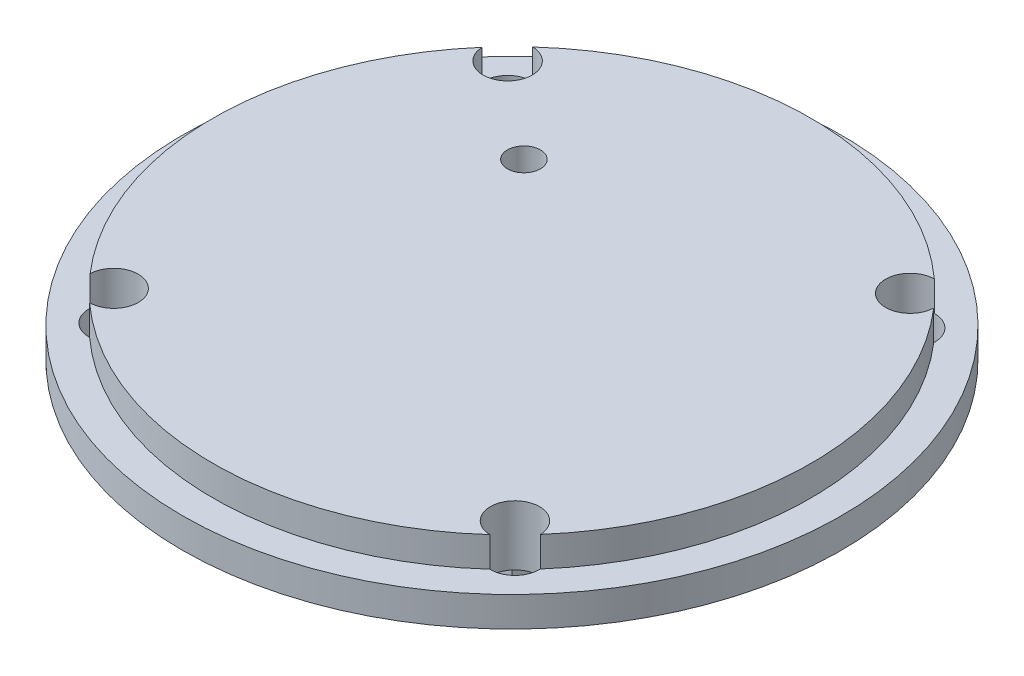
ISO-10303-21;
HEADER;
FILE_DESCRIPTION(('STEP AP214'),'2;1');
FILE_NAME('part.step','',(''),(''),'','','');
FILE_SCHEMA(('AUTOMOTIVE_DESIGN { 1 0 10303 214 1 1 1 1 }'));
ENDSEC;
DATA;
#1=APPLICATION_CONTEXT('core data for automotive mechanical design processes');
#2=APPLICATION_PROTOCOL_DEFINITION('international standard','automotive_design',2000,#1);
#3=PRODUCT_CONTEXT('',#1,'mechanical');
#4=PRODUCT('Part','Part','',(#3));
#5=PRODUCT_RELATED_PRODUCT_CATEGORY('part','',(#4));
#6=PRODUCT_DEFINITION_FORMATION('','',#4);
#7=PRODUCT_DEFINITION_CONTEXT('part definition',#1,'design');
#8=PRODUCT_DEFINITION('design','',#6,#7);
#9=PRODUCT_DEFINITION_SHAPE('','',#8);
#10=(LENGTH_UNIT() NAMED_UNIT(*) SI_UNIT(.MILLI.,.METRE.));
#11=(NAMED_UNIT(*) PLANE_ANGLE_UNIT() SI_UNIT($,.RADIAN.));
#12=(NAMED_UNIT(*) SI_UNIT($,.STERADIAN.) SOLID_ANGLE_UNIT());
#13=UNCERTAINTY_MEASURE_WITH_UNIT(LENGTH_MEASURE(1.E-05),#10,'distance_accuracy_value','');
#14=(GEOMETRIC_REPRESENTATION_CONTEXT(3) GLOBAL_UNCERTAINTY_ASSIGNED_CONTEXT((#13)) GLOBAL_UNIT_ASSIGNED_CONTEXT((#10,
#11,#12)) REPRESENTATION_CONTEXT('',''));
#15=CARTESIAN_POINT('',(0.,0.,0.));
#16=DIRECTION('',(0.,0.,1.));
#17=DIRECTION('',(1.,0.,0.));
#18=AXIS2_PLACEMENT_3D('',#15,#16,#17);
#19=CARTESIAN_POINT('',(0.,10.,0.));
#20=DIRECTION('',(0.,-1.,0.));
#21=DIRECTION('',(0.,0.,-1.));
#22=AXIS2_PLACEMENT_3D('',#19,#20,#21);
#23=CYLINDRICAL_SURFACE('',#22,49.9);
#24=CARTESIAN_POINT('',(0.,5.,0.));
#25=DIRECTION('',(0.,1.,0.));
#26=DIRECTION('',(0.,0.,1.));
#27=AXIS2_PLACEMENT_3D('',#24,#25,#26);
#28=CIRCLE('',#27,49.9);
#29=CARTESIAN_POINT('',(33.5133115533416,5.,-36.9711772699851));
#30=VERTEX_POINT('',#29);
#31=CARTESIAN_POINT('',(-33.5127812139844,5.,-36.9716580004686));
#32=VERTEX_POINT('',#31);
#33=EDGE_CURVE('E179',#30,#32,#28,.T.);
#34=ORIENTED_EDGE('',*,*,#33,.T.);
#35=DIRECTION('',(0.,-1.,0.));
#36=VECTOR('',#35,1.);
#37=CARTESIAN_POINT('',(-33.5127812139844,5.,-36.9716580004685));
#38=LINE('',#37,#36);
#39=CARTESIAN_POINT('',(-33.5127812139844,10.,-36.9716580004685));
#40=VERTEX_POINT('',#39);
#41=EDGE_CURVE('E266',#32,#40,#38,.F.);
#42=ORIENTED_EDGE('',*,*,#41,.T.);
#43=CARTESIAN_POINT('',(0.,10.,0.));
#44=DIRECTION('',(0.,1.,0.));
#45=DIRECTION('',(0.,0.,1.));
#46=AXIS2_PLACEMENT_3D('',#43,#44,#45);
#47=CIRCLE('',#46,49.9);
#48=CARTESIAN_POINT('',(33.5133115533416,10.,-36.9711772699851));
#49=VERTEX_POINT('',#48);
#50=EDGE_CURVE('E178',#49,#40,#47,.T.);
#51=ORIENTED_EDGE('',*,*,#50,.F.);
#52=DIRECTION('',(0.,-1.,0.));
#53=VECTOR('',#52,1.);
#54=CARTESIAN_POINT('',(33.5133115533416,5.,-36.971177269985));
#55=LINE('',#54,#53);
#56=EDGE_CURVE('E273',#49,#30,#55,.T.);
#57=ORIENTED_EDGE('',*,*,#56,.T.);
#58=EDGE_LOOP('',(#34,#42,#51,#57));
#59=FACE_BOUND('',#58,.T.);
#60=ADVANCED_FACE('F46',(#59),#23,.T.);
#61=CARTESIAN_POINT('',(-37.6882981979145,10.,-32.7047730300192));
#62=VERTEX_POINT('',#61);
#63=CARTESIAN_POINT('',(-37.6882981979144,10.,32.7047730300192));
#64=VERTEX_POINT('',#63);
#65=EDGE_CURVE('E175',#62,#64,#47,.T.);
#66=ORIENTED_EDGE('',*,*,#65,.F.);
#67=DIRECTION('',(0.,-1.,0.));
#68=VECTOR('',#67,1.);
#69=CARTESIAN_POINT('',(-37.6882981979144,5.,-32.7047730300192));
#70=LINE('',#69,#68);
#71=CARTESIAN_POINT('',(-37.6882981979145,5.,-32.7047730300193));
#72=VERTEX_POINT('',#71);
#73=EDGE_CURVE('E251',#62,#72,#70,.T.);
#74=ORIENTED_EDGE('',*,*,#73,.T.);
#75=CARTESIAN_POINT('',(-37.6882981979145,5.,32.7047730300192));
#76=VERTEX_POINT('',#75);
#77=EDGE_CURVE('E188',#72,#76,#28,.T.);
#78=ORIENTED_EDGE('',*,*,#77,.T.);
#79=DIRECTION('',(0.,-1.,0.));
#80=VECTOR('',#79,1.);
#81=CARTESIAN_POINT('',(-37.6882981979144,5.,32.7047730300192));
#82=LINE('',#81,#80);
#83=EDGE_CURVE('E250',#76,#64,#82,.F.);
#84=ORIENTED_EDGE('',*,*,#83,.T.);
#85=EDGE_LOOP('',(#66,#74,#78,#84));
#86=FACE_BOUND('',#85,.T.);
#87=ADVANCED_FACE('F249',(#86),#23,.T.);
#88=CARTESIAN_POINT('',(-33.5127812139844,10.,36.9716580004686));
#89=VERTEX_POINT('',#88);
#90=CARTESIAN_POINT('',(33.3904623101166,10.,37.0821658849194));
#91=VERTEX_POINT('',#90);
#92=EDGE_CURVE('E167',#89,#91,#47,.T.);
#93=ORIENTED_EDGE('',*,*,#92,.F.);
#94=DIRECTION('',(0.,-1.,0.));
#95=VECTOR('',#94,1.);
#96=CARTESIAN_POINT('',(-33.5127812139844,5.,36.9716580004685));
#97=LINE('',#96,#95);
#98=CARTESIAN_POINT('',(-33.5127812139844,5.,36.9716580004686));
#99=VERTEX_POINT('',#98);
#100=EDGE_CURVE('E68',#89,#99,#97,.T.);
#101=ORIENTED_EDGE('',*,*,#100,.T.);
#102=CARTESIAN_POINT('',(33.3904623101166,5.,37.0821658849194));
#103=VERTEX_POINT('',#102);
#104=EDGE_CURVE('E169',#99,#103,#28,.T.);
#105=ORIENTED_EDGE('',*,*,#104,.T.);
#106=DIRECTION('',(0.,-1.,0.));
#107=VECTOR('',#106,1.);
#108=CARTESIAN_POINT('',(33.3904623101166,5.,37.0821658849194));
#109=LINE('',#108,#107);
#110=EDGE_CURVE('E157',#103,#91,#109,.F.);
#111=ORIENTED_EDGE('',*,*,#110,.T.);
#112=EDGE_LOOP('',(#93,#101,#105,#111));
#113=FACE_BOUND('',#112,.T.);
#114=ADVANCED_FACE('F166',(#113),#23,.T.);
#115=CARTESIAN_POINT('',(0.,0.,0.));
#116=DIRECTION('',(0.,1.,0.));
#117=DIRECTION('',(0.,0.,1.));
#118=AXIS2_PLACEMENT_3D('',#115,#116,#117);
#119=PLANE('',#118);
#120=CARTESIAN_POINT('',(-17.9998565542273,0.,-19.9999999994856));
#121=DIRECTION('',(0.,1.,0.));
#122=DIRECTION('',(0.,0.,1.));
#123=AXIS2_PLACEMENT_3D('',#120,#121,#122);
#124=CIRCLE('',#123,2.75);
#125=CARTESIAN_POINT('',(-17.9998565542273,0.,-17.2499999994856));
#126=VERTEX_POINT('',#125);
#127=EDGE_CURVE('E526',#126,#126,#124,.T.);
#128=ORIENTED_EDGE('',*,*,#127,.T.);
#129=EDGE_LOOP('',(#128));
#130=FACE_BOUND('',#129,.T.);
#131=CARTESIAN_POINT('',(-33.5917270558466,0.,-32.8724181253145));
#132=DIRECTION('',(0.,-1.,0.));
#133=DIRECTION('',(0.,0.,-1.));
#134=AXIS2_PLACEMENT_3D('',#131,#132,#133);
#135=CIRCLE('',#134,4.1);
#136=CARTESIAN_POINT('',(-33.5917270558466,0.,-36.9724181253145));
#137=VERTEX_POINT('',#136);
#138=EDGE_CURVE('E536',#137,#137,#135,.T.);
#139=ORIENTED_EDGE('',*,*,#138,.F.);
#140=EDGE_LOOP('',(#139));
#141=FACE_BOUND('',#140,.T.);
#142=CARTESIAN_POINT('',(-33.5917270558466,0.,32.8724181253145));
#143=DIRECTION('',(0.,-1.,0.));
#144=DIRECTION('',(0.,0.,-1.));
#145=AXIS2_PLACEMENT_3D('',#142,#143,#144);
#146=CIRCLE('',#145,4.1);
#147=CARTESIAN_POINT('',(-33.5917270558466,0.,28.7724181253145));
#148=VERTEX_POINT('',#147);
#149=EDGE_CURVE('E530',#148,#148,#146,.T.);
#150=ORIENTED_EDGE('',*,*,#149,.F.);
#151=EDGE_LOOP('',(#150));
#152=FACE_BOUND('',#151,.T.);
#153=CARTESIAN_POINT('',(33.4832151770335,0.,32.9832151770335));
#154=DIRECTION('',(0.,-1.,0.));
#155=DIRECTION('',(0.,0.,-1.));
#156=AXIS2_PLACEMENT_3D('',#153,#154,#155);
#157=CIRCLE('',#156,4.1);
#158=CARTESIAN_POINT('',(33.4832151770335,0.,28.8832151770335));
#159=VERTEX_POINT('',#158);
#160=EDGE_CURVE('E527',#159,#159,#157,.T.);
#161=ORIENTED_EDGE('',*,*,#160,.F.);
#162=EDGE_LOOP('',(#161));
#163=FACE_BOUND('',#162,.T.);
#164=CARTESIAN_POINT('',(33.5921985983531,0.,-32.8719362629046));
#165=DIRECTION('',(0.,-1.,0.));
#166=DIRECTION('',(0.,0.,-1.));
#167=AXIS2_PLACEMENT_3D('',#164,#165,#166);
#168=CIRCLE('',#167,4.1);
#169=CARTESIAN_POINT('',(33.5921985983531,0.,-36.9719362629046));
#170=VERTEX_POINT('',#169);
#171=EDGE_CURVE('E269',#170,#170,#168,.T.);
#172=ORIENTED_EDGE('',*,*,#171,.F.);
#173=EDGE_LOOP('',(#172));
#174=FACE_BOUND('',#173,.T.);
#175=CARTESIAN_POINT('',(0.,0.,0.));
#176=DIRECTION('',(0.,1.,0.));
#177=DIRECTION('',(0.,0.,1.));
#178=AXIS2_PLACEMENT_3D('',#175,#176,#177);
#179=CIRCLE('',#178,55.);
#180=CARTESIAN_POINT('',(0.,0.,55.));
#181=VERTEX_POINT('',#180);
#182=EDGE_CURVE('E183',#181,#181,#179,.T.);
#183=ORIENTED_EDGE('',*,*,#182,.F.);
#184=EDGE_LOOP('',(#183));
#185=FACE_BOUND('',#184,.T.);
#186=DIRECTION('',(0.,0.,-1.));
#187=VECTOR('',#186,1.);
#188=CARTESIAN_POINT('',(-15.,0.,-15.));
#189=LINE('',#188,#187);
#190=CARTESIAN_POINT('',(-15.,0.,15.));
#191=VERTEX_POINT('',#190);
#192=CARTESIAN_POINT('',(-15.,0.,-15.));
#193=VERTEX_POINT('',#192);
#194=EDGE_CURVE('E201',#191,#193,#189,.T.);
#195=ORIENTED_EDGE('',*,*,#194,.F.);
#196=DIRECTION('',(-1.,0.,0.));
#197=VECTOR('',#196,1.);
#198=CARTESIAN_POINT('',(15.,0.,15.));
#199=LINE('',#198,#197);
#200=CARTESIAN_POINT('',(15.,0.,15.));
#201=VERTEX_POINT('',#200);
#202=EDGE_CURVE('E203',#201,#191,#199,.T.);
#203=ORIENTED_EDGE('',*,*,#202,.F.);
#204=DIRECTION('',(0.,0.,1.));
#205=VECTOR('',#204,1.);
#206=CARTESIAN_POINT('',(15.,0.,-15.));
#207=LINE('',#206,#205);
#208=CARTESIAN_POINT('',(15.,0.,-15.));
#209=VERTEX_POINT('',#208);
#210=EDGE_CURVE('E223',#209,#201,#207,.T.);
#211=ORIENTED_EDGE('',*,*,#210,.F.);
#212=DIRECTION('',(1.,0.,0.));
#213=VECTOR('',#212,1.);
#214=CARTESIAN_POINT('',(15.,0.,-15.));
#215=LINE('',#214,#213);
#216=EDGE_CURVE('E206',#193,#209,#215,.T.);
#217=ORIENTED_EDGE('',*,*,#216,.F.);
#218=EDGE_LOOP('',(#195,#203,#211,#217));
#219=FACE_BOUND('',#218,.T.);
#220=ADVANCED_FACE('F196',(#130,#141,#152,#163,#174,#185,#219),#119,.F.);
#221=CARTESIAN_POINT('',(0.,5.,0.));
#222=DIRECTION('',(0.,-1.,0.));
#223=DIRECTION('',(0.,0.,-1.));
#224=AXIS2_PLACEMENT_3D('',#221,#222,#223);
#225=CYLINDRICAL_SURFACE('',#224,55.);
#226=CARTESIAN_POINT('',(0.,5.,0.));
#227=DIRECTION('',(0.,1.,0.));
#228=DIRECTION('',(0.,0.,1.));
#229=AXIS2_PLACEMENT_3D('',#226,#227,#228);
#230=CIRCLE('',#229,55.);
#231=CARTESIAN_POINT('',(0.,5.,55.));
#232=VERTEX_POINT('',#231);
#233=EDGE_CURVE('E162',#232,#232,#230,.T.);
#234=ORIENTED_EDGE('',*,*,#233,.F.);
#235=EDGE_LOOP('',(#234));
#236=FACE_BOUND('',#235,.T.);
#237=ORIENTED_EDGE('',*,*,#182,.T.);
#238=EDGE_LOOP('',(#237));
#239=FACE_BOUND('',#238,.T.);
#240=ADVANCED_FACE('F48',(#236,#239),#225,.T.);
#241=CARTESIAN_POINT('',(0.,5.,0.));
#242=DIRECTION('',(0.,1.,0.));
#243=DIRECTION('',(0.,0.,1.));
#244=AXIS2_PLACEMENT_3D('',#241,#242,#243);
#245=PLANE('',#244);
#246=CARTESIAN_POINT('',(-33.5917270558466,5.,-32.8724181253145));
#247=DIRECTION('',(0.,1.,0.));
#248=DIRECTION('',(0.,0.,1.));
#249=AXIS2_PLACEMENT_3D('',#246,#247,#248);
#250=CIRCLE('',#249,4.1);
#251=EDGE_CURVE('E258',#32,#72,#250,.T.);
#252=ORIENTED_EDGE('',*,*,#251,.F.);
#253=ORIENTED_EDGE('',*,*,#33,.F.);
#254=CARTESIAN_POINT('',(33.5921985983531,5.,-32.8719362629046));
#255=DIRECTION('',(0.,1.,0.));
#256=DIRECTION('',(0.,0.,1.));
#257=AXIS2_PLACEMENT_3D('',#254,#255,#256);
#258=CIRCLE('',#257,4.1);
#259=CARTESIAN_POINT('',(37.6887673349716,5.,-32.7042323984278));
#260=VERTEX_POINT('',#259);
#261=EDGE_CURVE('E278',#260,#30,#258,.T.);
#262=ORIENTED_EDGE('',*,*,#261,.F.);
#263=CARTESIAN_POINT('',(37.5803065911866,5.,32.8288068091489));
#264=VERTEX_POINT('',#263);
#265=EDGE_CURVE('E189',#264,#260,#28,.T.);
#266=ORIENTED_EDGE('',*,*,#265,.F.);
#267=CARTESIAN_POINT('',(33.4832151770335,5.,32.9832151770335));
#268=DIRECTION('',(0.,1.,0.));
#269=DIRECTION('',(0.,0.,1.));
#270=AXIS2_PLACEMENT_3D('',#267,#268,#269);
#271=CIRCLE('',#270,4.1);
#272=EDGE_CURVE('E170',#103,#264,#271,.T.);
#273=ORIENTED_EDGE('',*,*,#272,.F.);
#274=ORIENTED_EDGE('',*,*,#104,.F.);
#275=CARTESIAN_POINT('',(-33.5917270558466,5.,32.8724181253145));
#276=DIRECTION('',(0.,1.,0.));
#277=DIRECTION('',(0.,0.,1.));
#278=AXIS2_PLACEMENT_3D('',#275,#276,#277);
#279=CIRCLE('',#278,4.1);
#280=EDGE_CURVE('E259',#76,#99,#279,.T.);
#281=ORIENTED_EDGE('',*,*,#280,.F.);
#282=ORIENTED_EDGE('',*,*,#77,.F.);
#283=EDGE_LOOP('',(#252,#253,#262,#266,#273,#274,#281,#282));
#284=FACE_BOUND('',#283,.T.);
#285=ORIENTED_EDGE('',*,*,#233,.T.);
#286=EDGE_LOOP('',(#285));
#287=FACE_BOUND('',#286,.T.);
#288=ADVANCED_FACE('F255',(#284,#287),#245,.T.);
#289=CARTESIAN_POINT('',(37.5803065911866,10.,32.8288068091489));
#290=VERTEX_POINT('',#289);
#291=CARTESIAN_POINT('',(37.6887673349715,10.,-32.7042323984278));
#292=VERTEX_POINT('',#291);
#293=EDGE_CURVE('E176',#290,#292,#47,.T.);
#294=ORIENTED_EDGE('',*,*,#293,.F.);
#295=DIRECTION('',(0.,-1.,0.));
#296=VECTOR('',#295,1.);
#297=CARTESIAN_POINT('',(37.5803065911866,5.,32.8288068091489));
#298=LINE('',#297,#296);
#299=EDGE_CURVE('E61',#290,#264,#298,.T.);
#300=ORIENTED_EDGE('',*,*,#299,.T.);
#301=ORIENTED_EDGE('',*,*,#265,.T.);
#302=DIRECTION('',(0.,-1.,0.));
#303=VECTOR('',#302,1.);
#304=CARTESIAN_POINT('',(37.6887673349715,5.,-32.7042323984278));
#305=LINE('',#304,#303);
#306=EDGE_CURVE('E280',#260,#292,#305,.F.);
#307=ORIENTED_EDGE('',*,*,#306,.T.);
#308=EDGE_LOOP('',(#294,#300,#301,#307));
#309=FACE_BOUND('',#308,.T.);
#310=ADVANCED_FACE('F336',(#309),#23,.T.);
#311=CARTESIAN_POINT('',(0.,10.,0.));
#312=DIRECTION('',(0.,1.,0.));
#313=DIRECTION('',(0.,0.,1.));
#314=AXIS2_PLACEMENT_3D('',#311,#312,#313);
#315=PLANE('',#314);
#316=CARTESIAN_POINT('',(-17.9998565542273,10.,-19.9999999994856));
#317=DIRECTION('',(0.,1.,0.));
#318=DIRECTION('',(0.,0.,1.));
#319=AXIS2_PLACEMENT_3D('',#316,#317,#318);
#320=CIRCLE('',#319,2.75);
#321=CARTESIAN_POINT('',(-17.9998565542273,10.,-17.2499999994856));
#322=VERTEX_POINT('',#321);
#323=EDGE_CURVE('E523',#322,#322,#320,.T.);
#324=ORIENTED_EDGE('',*,*,#323,.F.);
#325=EDGE_LOOP('',(#324));
#326=FACE_BOUND('',#325,.T.);
#327=CARTESIAN_POINT('',(-33.5917270558466,10.,-32.8724181253145));
#328=DIRECTION('',(0.,-1.,0.));
#329=DIRECTION('',(0.,0.,-1.));
#330=AXIS2_PLACEMENT_3D('',#327,#328,#329);
#331=CIRCLE('',#330,4.1);
#332=EDGE_CURVE('E534',#40,#62,#331,.T.);
#333=ORIENTED_EDGE('',*,*,#332,.T.);
#334=ORIENTED_EDGE('',*,*,#65,.T.);
#335=CARTESIAN_POINT('',(-33.5917270558466,10.,32.8724181253145));
#336=DIRECTION('',(0.,1.,0.));
#337=DIRECTION('',(0.,0.,1.));
#338=AXIS2_PLACEMENT_3D('',#335,#336,#337);
#339=CIRCLE('',#338,4.1);
#340=EDGE_CURVE('E13',#89,#64,#339,.T.);
#341=ORIENTED_EDGE('',*,*,#340,.F.);
#342=ORIENTED_EDGE('',*,*,#92,.T.);
#343=CARTESIAN_POINT('',(33.4832151770335,10.,32.9832151770335));
#344=DIRECTION('',(0.,1.,0.));
#345=DIRECTION('',(0.,0.,1.));
#346=AXIS2_PLACEMENT_3D('',#343,#344,#345);
#347=CIRCLE('',#346,4.1);
#348=EDGE_CURVE('E54',#290,#91,#347,.T.);
#349=ORIENTED_EDGE('',*,*,#348,.F.);
#350=ORIENTED_EDGE('',*,*,#293,.T.);
#351=CARTESIAN_POINT('',(33.5921985983531,10.,-32.8719362629046));
#352=DIRECTION('',(0.,-1.,0.));
#353=DIRECTION('',(0.,0.,-1.));
#354=AXIS2_PLACEMENT_3D('',#351,#352,#353);
#355=CIRCLE('',#354,4.1);
#356=EDGE_CURVE('E270',#292,#49,#355,.T.);
#357=ORIENTED_EDGE('',*,*,#356,.T.);
#358=ORIENTED_EDGE('',*,*,#50,.T.);
#359=EDGE_LOOP('',(#333,#334,#341,#342,#349,#350,#357,#358));
#360=FACE_BOUND('',#359,.T.);
#361=ADVANCED_FACE('F173',(#326,#360),#315,.T.);
#362=CARTESIAN_POINT('',(-15.,-20.,-15.));
#363=DIRECTION('',(1.,0.,0.));
#364=DIRECTION('',(0.,0.,-1.));
#365=AXIS2_PLACEMENT_3D('',#362,#363,#364);
#366=PLANE('',#365);
#367=ORIENTED_EDGE('',*,*,#194,.T.);
#368=DIRECTION('',(0.,1.,0.));
#369=VECTOR('',#368,1.);
#370=CARTESIAN_POINT('',(-15.,-20.,-15.));
#371=LINE('',#370,#369);
#372=CARTESIAN_POINT('',(-15.,-20.,-15.));
#373=VERTEX_POINT('',#372);
#374=EDGE_CURVE('E184',#373,#193,#371,.T.);
#375=ORIENTED_EDGE('',*,*,#374,.F.);
#376=DIRECTION('',(0.,0.,-1.));
#377=VECTOR('',#376,1.);
#378=CARTESIAN_POINT('',(-15.,-20.,-15.));
#379=LINE('',#378,#377);
#380=CARTESIAN_POINT('',(-15.,-20.,15.));
#381=VERTEX_POINT('',#380);
#382=EDGE_CURVE('E222',#381,#373,#379,.T.);
#383=ORIENTED_EDGE('',*,*,#382,.F.);
#384=DIRECTION('',(0.,1.,0.));
#385=VECTOR('',#384,1.);
#386=CARTESIAN_POINT('',(-15.,-20.,15.));
#387=LINE('',#386,#385);
#388=EDGE_CURVE('E218',#381,#191,#387,.T.);
#389=ORIENTED_EDGE('',*,*,#388,.T.);
#390=EDGE_LOOP('',(#367,#375,#383,#389));
#391=FACE_BOUND('',#390,.T.);
#392=ADVANCED_FACE('F225',(#391),#366,.F.);
#393=CARTESIAN_POINT('',(15.,-20.,-15.));
#394=DIRECTION('',(0.,0.,1.));
#395=DIRECTION('',(1.,0.,0.));
#396=AXIS2_PLACEMENT_3D('',#393,#394,#395);
#397=PLANE('',#396);
#398=DIRECTION('',(-1.,0.,0.));
#399=VECTOR('',#398,1.);
#400=CARTESIAN_POINT('',(15.,-4.9,-15.));
#401=LINE('',#400,#399);
#402=CARTESIAN_POINT('',(10.1,-4.9,-15.));
#403=VERTEX_POINT('',#402);
#404=CARTESIAN_POINT('',(-10.1,-4.9,-15.));
#405=VERTEX_POINT('',#404);
#406=EDGE_CURVE('E308',#403,#405,#401,.T.);
#407=ORIENTED_EDGE('',*,*,#406,.T.);
#408=DIRECTION('',(0.,-1.,0.));
#409=VECTOR('',#408,1.);
#410=CARTESIAN_POINT('',(-10.1,-20.,-15.));
#411=LINE('',#410,#409);
#412=CARTESIAN_POINT('',(-10.1,-15.1,-15.));
#413=VERTEX_POINT('',#412);
#414=EDGE_CURVE('E211',#405,#413,#411,.T.);
#415=ORIENTED_EDGE('',*,*,#414,.T.);
#416=DIRECTION('',(1.,0.,0.));
#417=VECTOR('',#416,1.);
#418=CARTESIAN_POINT('',(15.,-15.1,-15.));
#419=LINE('',#418,#417);
#420=CARTESIAN_POINT('',(10.1,-15.1,-15.));
#421=VERTEX_POINT('',#420);
#422=EDGE_CURVE('E296',#413,#421,#419,.T.);
#423=ORIENTED_EDGE('',*,*,#422,.T.);
#424=DIRECTION('',(0.,1.,0.));
#425=VECTOR('',#424,1.);
#426=CARTESIAN_POINT('',(10.1,-20.,-15.));
#427=LINE('',#426,#425);
#428=EDGE_CURVE('E305',#421,#403,#427,.T.);
#429=ORIENTED_EDGE('',*,*,#428,.T.);
#430=EDGE_LOOP('',(#407,#415,#423,#429));
#431=FACE_BOUND('',#430,.T.);
#432=ORIENTED_EDGE('',*,*,#216,.T.);
#433=DIRECTION('',(0.,1.,0.));
#434=VECTOR('',#433,1.);
#435=CARTESIAN_POINT('',(15.,-20.,-15.));
#436=LINE('',#435,#434);
#437=CARTESIAN_POINT('',(15.,-20.,-15.));
#438=VERTEX_POINT('',#437);
#439=EDGE_CURVE('E229',#438,#209,#436,.T.);
#440=ORIENTED_EDGE('',*,*,#439,.F.);
#441=DIRECTION('',(1.,0.,0.));
#442=VECTOR('',#441,1.);
#443=CARTESIAN_POINT('',(15.,-20.,-15.));
#444=LINE('',#443,#442);
#445=EDGE_CURVE('E314',#373,#438,#444,.T.);
#446=ORIENTED_EDGE('',*,*,#445,.F.);
#447=ORIENTED_EDGE('',*,*,#374,.T.);
#448=EDGE_LOOP('',(#432,#440,#446,#447));
#449=FACE_BOUND('',#448,.T.);
#450=ADVANCED_FACE('F318',(#431,#449),#397,.F.);
#451=CARTESIAN_POINT('',(15.,-20.,-15.));
#452=DIRECTION('',(-1.,0.,0.));
#453=DIRECTION('',(0.,0.,1.));
#454=AXIS2_PLACEMENT_3D('',#451,#452,#453);
#455=PLANE('',#454);
#456=ORIENTED_EDGE('',*,*,#210,.T.);
#457=DIRECTION('',(0.,1.,0.));
#458=VECTOR('',#457,1.);
#459=CARTESIAN_POINT('',(15.,-20.,15.));
#460=LINE('',#459,#458);
#461=CARTESIAN_POINT('',(15.,-20.,15.));
#462=VERTEX_POINT('',#461);
#463=EDGE_CURVE('E221',#462,#201,#460,.T.);
#464=ORIENTED_EDGE('',*,*,#463,.F.);
#465=DIRECTION('',(0.,0.,1.));
#466=VECTOR('',#465,1.);
#467=CARTESIAN_POINT('',(15.,-20.,-15.));
#468=LINE('',#467,#466);
#469=EDGE_CURVE('E231',#438,#462,#468,.T.);
#470=ORIENTED_EDGE('',*,*,#469,.F.);
#471=ORIENTED_EDGE('',*,*,#439,.T.);
#472=EDGE_LOOP('',(#456,#464,#470,#471));
#473=FACE_BOUND('',#472,.T.);
#474=ADVANCED_FACE('F317',(#473),#455,.F.);
#475=CARTESIAN_POINT('',(15.,-20.,15.));
#476=DIRECTION('',(0.,0.,-1.));
#477=DIRECTION('',(-1.,0.,0.));
#478=AXIS2_PLACEMENT_3D('',#475,#476,#477);
#479=PLANE('',#478);
#480=DIRECTION('',(1.,0.,0.));
#481=VECTOR('',#480,1.);
#482=CARTESIAN_POINT('',(10.1,-15.1,15.));
#483=LINE('',#482,#481);
#484=CARTESIAN_POINT('',(-10.1,-15.1,15.));
#485=VERTEX_POINT('',#484);
#486=CARTESIAN_POINT('',(10.1,-15.1,15.));
#487=VERTEX_POINT('',#486);
#488=EDGE_CURVE('E284',#485,#487,#483,.T.);
#489=ORIENTED_EDGE('',*,*,#488,.F.);
#490=DIRECTION('',(0.,-1.,0.));
#491=VECTOR('',#490,1.);
#492=CARTESIAN_POINT('',(-10.1,-15.1,15.));
#493=LINE('',#492,#491);
#494=CARTESIAN_POINT('',(-10.1,-4.9,15.));
#495=VERTEX_POINT('',#494);
#496=EDGE_CURVE('E282',#495,#485,#493,.T.);
#497=ORIENTED_EDGE('',*,*,#496,.F.);
#498=DIRECTION('',(-1.,0.,0.));
#499=VECTOR('',#498,1.);
#500=CARTESIAN_POINT('',(10.1,-4.9,15.));
#501=LINE('',#500,#499);
#502=CARTESIAN_POINT('',(10.1,-4.9,15.));
#503=VERTEX_POINT('',#502);
#504=EDGE_CURVE('E290',#503,#495,#501,.T.);
#505=ORIENTED_EDGE('',*,*,#504,.F.);
#506=DIRECTION('',(0.,1.,0.));
#507=VECTOR('',#506,1.);
#508=CARTESIAN_POINT('',(10.1,-15.1,15.));
#509=LINE('',#508,#507);
#510=EDGE_CURVE('E287',#487,#503,#509,.T.);
#511=ORIENTED_EDGE('',*,*,#510,.F.);
#512=EDGE_LOOP('',(#489,#497,#505,#511));
#513=FACE_BOUND('',#512,.T.);
#514=ORIENTED_EDGE('',*,*,#202,.T.);
#515=ORIENTED_EDGE('',*,*,#388,.F.);
#516=DIRECTION('',(-1.,0.,0.));
#517=VECTOR('',#516,1.);
#518=CARTESIAN_POINT('',(15.,-20.,15.));
#519=LINE('',#518,#517);
#520=EDGE_CURVE('E227',#462,#381,#519,.T.);
#521=ORIENTED_EDGE('',*,*,#520,.F.);
#522=ORIENTED_EDGE('',*,*,#463,.T.);
#523=EDGE_LOOP('',(#514,#515,#521,#522));
#524=FACE_BOUND('',#523,.T.);
#525=ADVANCED_FACE('F216',(#513,#524),#479,.F.);
#526=CARTESIAN_POINT('',(0.,-20.,0.));
#527=DIRECTION('',(0.,-1.,0.));
#528=DIRECTION('',(0.,0.,-1.));
#529=AXIS2_PLACEMENT_3D('',#526,#527,#528);
#530=PLANE('',#529);
#531=ORIENTED_EDGE('',*,*,#382,.T.);
#532=ORIENTED_EDGE('',*,*,#445,.T.);
#533=ORIENTED_EDGE('',*,*,#469,.T.);
#534=ORIENTED_EDGE('',*,*,#520,.T.);
#535=EDGE_LOOP('',(#531,#532,#533,#534));
#536=FACE_BOUND('',#535,.T.);
#537=ADVANCED_FACE('F320',(#536),#530,.T.);
#538=CARTESIAN_POINT('',(-10.1,-15.1,-55.));
#539=DIRECTION('',(-1.,0.,0.));
#540=DIRECTION('',(0.,0.,1.));
#541=AXIS2_PLACEMENT_3D('',#538,#539,#540);
#542=PLANE('',#541);
#543=DIRECTION('',(0.,0.,1.));
#544=VECTOR('',#543,1.);
#545=CARTESIAN_POINT('',(-10.1,-4.9,-55.));
#546=LINE('',#545,#544);
#547=EDGE_CURVE('E294',#405,#495,#546,.T.);
#548=ORIENTED_EDGE('',*,*,#547,.T.);
#549=ORIENTED_EDGE('',*,*,#496,.T.);
#550=DIRECTION('',(0.,0.,1.));
#551=VECTOR('',#550,1.);
#552=CARTESIAN_POINT('',(-10.1,-15.1,-55.));
#553=LINE('',#552,#551);
#554=EDGE_CURVE('E293',#413,#485,#553,.T.);
#555=ORIENTED_EDGE('',*,*,#554,.F.);
#556=ORIENTED_EDGE('',*,*,#414,.F.);
#557=EDGE_LOOP('',(#548,#549,#555,#556));
#558=FACE_BOUND('',#557,.T.);
#559=ADVANCED_FACE('F322',(#558),#542,.F.);
#560=CARTESIAN_POINT('',(10.1,-4.9,-55.));
#561=DIRECTION('',(0.,1.,0.));
#562=DIRECTION('',(-1.,0.,0.));
#563=AXIS2_PLACEMENT_3D('',#560,#561,#562);
#564=PLANE('',#563);
#565=DIRECTION('',(0.,0.,1.));
#566=VECTOR('',#565,1.);
#567=CARTESIAN_POINT('',(10.1,-4.9,-55.));
#568=LINE('',#567,#566);
#569=EDGE_CURVE('E297',#403,#503,#568,.T.);
#570=ORIENTED_EDGE('',*,*,#569,.T.);
#571=ORIENTED_EDGE('',*,*,#504,.T.);
#572=ORIENTED_EDGE('',*,*,#547,.F.);
#573=ORIENTED_EDGE('',*,*,#406,.F.);
#574=EDGE_LOOP('',(#570,#571,#572,#573));
#575=FACE_BOUND('',#574,.T.);
#576=ADVANCED_FACE('F328',(#575),#564,.F.);
#577=CARTESIAN_POINT('',(10.1,-15.1,-55.));
#578=DIRECTION('',(1.,0.,0.));
#579=DIRECTION('',(0.,0.,-1.));
#580=AXIS2_PLACEMENT_3D('',#577,#578,#579);
#581=PLANE('',#580);
#582=DIRECTION('',(0.,0.,1.));
#583=VECTOR('',#582,1.);
#584=CARTESIAN_POINT('',(10.1,-15.1,-55.));
#585=LINE('',#584,#583);
#586=EDGE_CURVE('E299',#421,#487,#585,.T.);
#587=ORIENTED_EDGE('',*,*,#586,.T.);
#588=ORIENTED_EDGE('',*,*,#510,.T.);
#589=ORIENTED_EDGE('',*,*,#569,.F.);
#590=ORIENTED_EDGE('',*,*,#428,.F.);
#591=EDGE_LOOP('',(#587,#588,#589,#590));
#592=FACE_BOUND('',#591,.T.);
#593=ADVANCED_FACE('F470',(#592),#581,.F.);
#594=CARTESIAN_POINT('',(10.1,-15.1,-55.));
#595=DIRECTION('',(0.,-1.,0.));
#596=DIRECTION('',(1.,0.,0.));
#597=AXIS2_PLACEMENT_3D('',#594,#595,#596);
#598=PLANE('',#597);
#599=ORIENTED_EDGE('',*,*,#554,.T.);
#600=ORIENTED_EDGE('',*,*,#488,.T.);
#601=ORIENTED_EDGE('',*,*,#586,.F.);
#602=ORIENTED_EDGE('',*,*,#422,.F.);
#603=EDGE_LOOP('',(#599,#600,#601,#602));
#604=FACE_BOUND('',#603,.T.);
#605=ADVANCED_FACE('F385',(#604),#598,.F.);
#606=CARTESIAN_POINT('',(33.5921985983531,10.,-32.8719362629046));
#607=DIRECTION('',(0.,-1.,0.));
#608=DIRECTION('',(0.,0.,-1.));
#609=AXIS2_PLACEMENT_3D('',#606,#607,#608);
#610=CYLINDRICAL_SURFACE('',#609,4.1);
#611=ORIENTED_EDGE('',*,*,#171,.T.);
#612=EDGE_LOOP('',(#611));
#613=FACE_BOUND('',#612,.T.);
#614=ORIENTED_EDGE('',*,*,#261,.T.);
#615=ORIENTED_EDGE('',*,*,#56,.F.);
#616=ORIENTED_EDGE('',*,*,#356,.F.);
#617=ORIENTED_EDGE('',*,*,#306,.F.);
#618=EDGE_LOOP('',(#614,#615,#616,#617));
#619=FACE_BOUND('',#618,.T.);
#620=ADVANCED_FACE('F380',(#613,#619),#610,.F.);
#621=CARTESIAN_POINT('',(33.4832151770335,10.,32.9832151770335));
#622=DIRECTION('',(0.,-1.,0.));
#623=DIRECTION('',(0.,0.,-1.));
#624=AXIS2_PLACEMENT_3D('',#621,#622,#623);
#625=CYLINDRICAL_SURFACE('',#624,4.1);
#626=ORIENTED_EDGE('',*,*,#160,.T.);
#627=EDGE_LOOP('',(#626));
#628=FACE_BOUND('',#627,.T.);
#629=ORIENTED_EDGE('',*,*,#272,.T.);
#630=ORIENTED_EDGE('',*,*,#299,.F.);
#631=ORIENTED_EDGE('',*,*,#348,.T.);
#632=ORIENTED_EDGE('',*,*,#110,.F.);
#633=EDGE_LOOP('',(#629,#630,#631,#632));
#634=FACE_BOUND('',#633,.T.);
#635=ADVANCED_FACE('F156',(#628,#634),#625,.F.);
#636=CARTESIAN_POINT('',(-33.5917270558466,10.,32.8724181253145));
#637=DIRECTION('',(0.,-1.,0.));
#638=DIRECTION('',(0.,0.,-1.));
#639=AXIS2_PLACEMENT_3D('',#636,#637,#638);
#640=CYLINDRICAL_SURFACE('',#639,4.1);
#641=ORIENTED_EDGE('',*,*,#149,.T.);
#642=EDGE_LOOP('',(#641));
#643=FACE_BOUND('',#642,.T.);
#644=ORIENTED_EDGE('',*,*,#280,.T.);
#645=ORIENTED_EDGE('',*,*,#100,.F.);
#646=ORIENTED_EDGE('',*,*,#340,.T.);
#647=ORIENTED_EDGE('',*,*,#83,.F.);
#648=EDGE_LOOP('',(#644,#645,#646,#647));
#649=FACE_BOUND('',#648,.T.);
#650=ADVANCED_FACE('F397',(#643,#649),#640,.F.);
#651=CARTESIAN_POINT('',(-33.5917270558466,10.,-32.8724181253145));
#652=DIRECTION('',(0.,-1.,0.));
#653=DIRECTION('',(0.,0.,-1.));
#654=AXIS2_PLACEMENT_3D('',#651,#652,#653);
#655=CYLINDRICAL_SURFACE('',#654,4.1);
#656=ORIENTED_EDGE('',*,*,#138,.T.);
#657=EDGE_LOOP('',(#656));
#658=FACE_BOUND('',#657,.T.);
#659=ORIENTED_EDGE('',*,*,#251,.T.);
#660=ORIENTED_EDGE('',*,*,#73,.F.);
#661=ORIENTED_EDGE('',*,*,#332,.F.);
#662=ORIENTED_EDGE('',*,*,#41,.F.);
#663=EDGE_LOOP('',(#659,#660,#661,#662));
#664=FACE_BOUND('',#663,.T.);
#665=ADVANCED_FACE('F406',(#658,#664),#655,.F.);
#666=CARTESIAN_POINT('',(-17.9998565542273,-20.,-19.9999999994856));
#667=DIRECTION('',(0.,1.,0.));
#668=DIRECTION('',(0.,0.,1.));
#669=AXIS2_PLACEMENT_3D('',#666,#667,#668);
#670=CYLINDRICAL_SURFACE('',#669,2.75);
#671=ORIENTED_EDGE('',*,*,#323,.T.);
#672=EDGE_LOOP('',(#671));
#673=FACE_BOUND('',#672,.T.);
#674=ORIENTED_EDGE('',*,*,#127,.F.);
#675=EDGE_LOOP('',(#674));
#676=FACE_BOUND('',#675,.T.);
#677=ADVANCED_FACE('F415',(#673,#676),#670,.F.);
#678=CLOSED_SHELL('',(#60,#87,#114,#220,#240,#288,#310,#361,#392,#450,#474,#525,#537,#559,#576,
#593,#605,#620,#635,#650,#665,#677));
#679=MANIFOLD_SOLID_BREP('B2',#678);
#680=ADVANCED_BREP_SHAPE_REPRESENTATION('',(#18,#679),#14);
#681=SHAPE_DEFINITION_REPRESENTATION(#9,#680);
ENDSEC;
END-ISO-10303-21;
